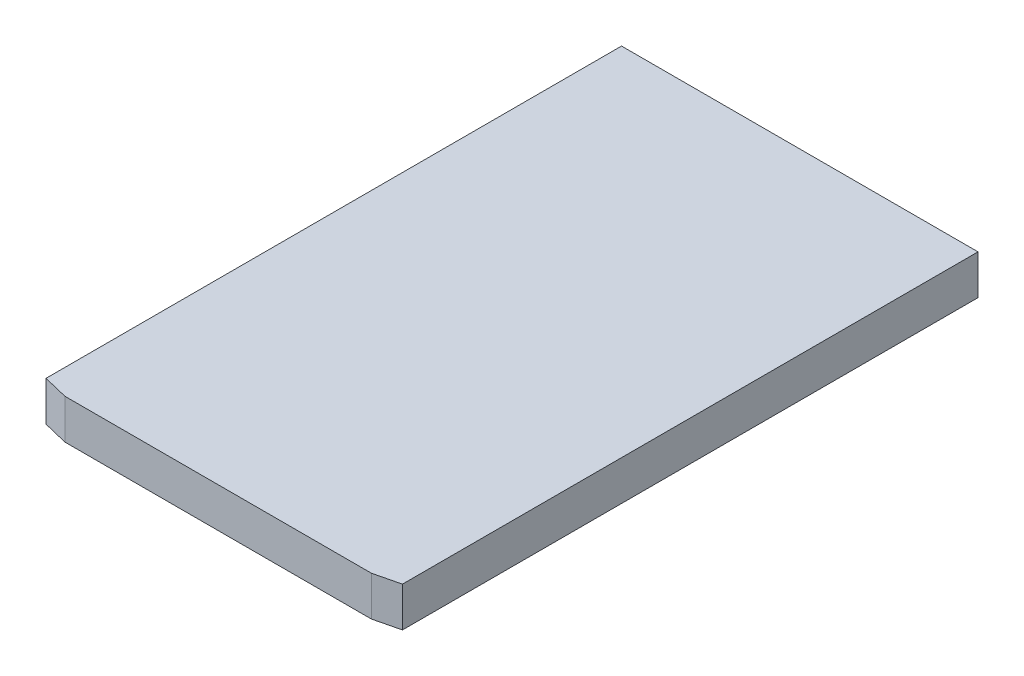
ISO-10303-21;
HEADER;
FILE_DESCRIPTION(('STEP AP214'),'2;1');
FILE_NAME('part.step','',(''),(''),'','','');
FILE_SCHEMA(('AUTOMOTIVE_DESIGN { 1 0 10303 214 1 1 1 1 }'));
ENDSEC;
DATA;
#1=APPLICATION_CONTEXT('core data for automotive mechanical design processes');
#2=APPLICATION_PROTOCOL_DEFINITION('international standard','automotive_design',2000,#1);
#3=PRODUCT_CONTEXT('',#1,'mechanical');
#4=PRODUCT('Part','Part','',(#3));
#5=PRODUCT_RELATED_PRODUCT_CATEGORY('part','',(#4));
#6=PRODUCT_DEFINITION_FORMATION('','',#4);
#7=PRODUCT_DEFINITION_CONTEXT('part definition',#1,'design');
#8=PRODUCT_DEFINITION('design','',#6,#7);
#9=PRODUCT_DEFINITION_SHAPE('','',#8);
#10=(LENGTH_UNIT() NAMED_UNIT(*) SI_UNIT(.MILLI.,.METRE.));
#11=(NAMED_UNIT(*) PLANE_ANGLE_UNIT() SI_UNIT($,.RADIAN.));
#12=(NAMED_UNIT(*) SI_UNIT($,.STERADIAN.) SOLID_ANGLE_UNIT());
#13=UNCERTAINTY_MEASURE_WITH_UNIT(LENGTH_MEASURE(1.E-05),#10,'distance_accuracy_value','');
#14=(GEOMETRIC_REPRESENTATION_CONTEXT(3) GLOBAL_UNCERTAINTY_ASSIGNED_CONTEXT((#13)) GLOBAL_UNIT_ASSIGNED_CONTEXT((#10,
#11,#12)) REPRESENTATION_CONTEXT('',''));
#15=CARTESIAN_POINT('',(0.,0.,0.));
#16=DIRECTION('',(0.,0.,1.));
#17=DIRECTION('',(1.,0.,0.));
#18=AXIS2_PLACEMENT_3D('',#15,#16,#17);
#19=CARTESIAN_POINT('',(0.,-66.,0.100005032445752));
#20=DIRECTION('',(0.,-1.,0.));
#21=DIRECTION('',(0.,0.,-1.));
#22=AXIS2_PLACEMENT_3D('',#19,#20,#21);
#23=PLANE('',#22);
#24=DIRECTION('',(1.,0.,0.));
#25=VECTOR('',#24,1.);
#26=CARTESIAN_POINT('',(12.25,-66.,35.2499999999999));
#27=LINE('',#26,#25);
#28=CARTESIAN_POINT('',(-12.2500000000025,-66.0000000000021,35.2499999999999));
#29=VERTEX_POINT('',#28);
#30=CARTESIAN_POINT('',(12.25,-66.,35.25));
#31=VERTEX_POINT('',#30);
#32=EDGE_CURVE('E66',#29,#31,#27,.T.);
#33=ORIENTED_EDGE('',*,*,#32,.F.);
#34=DIRECTION('',(0.971714790279196,0.,0.236157503274105));
#35=VECTOR('',#34,1.);
#36=CARTESIAN_POINT('',(-74.9989954719028,-66.0000000000083,20.0000045776342));
#37=LINE('',#36,#35);
#38=CARTESIAN_POINT('',(-14.2500000000032,-66.0000000000021,34.7639365879101));
#39=VERTEX_POINT('',#38);
#40=EDGE_CURVE('E93',#39,#29,#37,.T.);
#41=ORIENTED_EDGE('',*,*,#40,.F.);
#42=DIRECTION('',(0.,0.,1.));
#43=VECTOR('',#42,1.);
#44=CARTESIAN_POINT('',(-14.25,-66.,33.25));
#45=LINE('',#44,#43);
#46=CARTESIAN_POINT('',(-14.2500000000007,-66.,-11.2500000000043));
#47=VERTEX_POINT('',#46);
#48=EDGE_CURVE('E97',#47,#39,#45,.T.);
#49=ORIENTED_EDGE('',*,*,#48,.F.);
#50=DIRECTION('',(-1.,0.,0.));
#51=VECTOR('',#50,1.);
#52=CARTESIAN_POINT('',(-12.2499999999998,-66.,-11.2500000000003));
#53=LINE('',#52,#51);
#54=CARTESIAN_POINT('',(14.25,-66.0000000000364,-11.2500000000002));
#55=VERTEX_POINT('',#54);
#56=EDGE_CURVE('E82',#55,#47,#53,.T.);
#57=ORIENTED_EDGE('',*,*,#56,.F.);
#58=DIRECTION('',(0.,0.,1.));
#59=VECTOR('',#58,1.);
#60=CARTESIAN_POINT('',(14.25,-66.0000000000728,23.4717912863478));
#61=LINE('',#60,#59);
#62=CARTESIAN_POINT('',(14.25,-66.0000000000182,34.763936587932));
#63=VERTEX_POINT('',#62);
#64=EDGE_CURVE('E20',#63,#55,#61,.F.);
#65=ORIENTED_EDGE('',*,*,#64,.F.);
#66=DIRECTION('',(0.971714790279195,0.,-0.236157503274106));
#67=VECTOR('',#66,1.);
#68=CARTESIAN_POINT('',(12.25,-66.,35.25));
#69=LINE('',#68,#67);
#70=EDGE_CURVE('E71',#31,#63,#69,.T.);
#71=ORIENTED_EDGE('',*,*,#70,.F.);
#72=EDGE_LOOP('',(#33,#41,#49,#57,#65,#71));
#73=FACE_BOUND('',#72,.T.);
#74=ADVANCED_FACE('F17',(#73),#23,.T.);
#75=CARTESIAN_POINT('',(14.25,-23.,23.4717912863478));
#76=DIRECTION('',(1.,0.,0.));
#77=DIRECTION('',(0.,1.,0.));
#78=AXIS2_PLACEMENT_3D('',#75,#76,#77);
#79=PLANE('',#78);
#80=ORIENTED_EDGE('',*,*,#64,.T.);
#81=DIRECTION('',(0.,1.,0.));
#82=VECTOR('',#81,1.);
#83=CARTESIAN_POINT('',(14.25,-23.,-11.2500000000001));
#84=LINE('',#83,#82);
#85=CARTESIAN_POINT('',(14.25,-62.825,-11.250000000004));
#86=VERTEX_POINT('',#85);
#87=EDGE_CURVE('E101',#86,#55,#84,.F.);
#88=ORIENTED_EDGE('',*,*,#87,.F.);
#89=DIRECTION('',(0.,0.,-1.));
#90=VECTOR('',#89,1.);
#91=CARTESIAN_POINT('',(14.25,-62.825,0.100005032445854));
#92=LINE('',#91,#90);
#93=CARTESIAN_POINT('',(14.25,-62.825,34.7639365879014));
#94=VERTEX_POINT('',#93);
#95=EDGE_CURVE('E88',#86,#94,#92,.F.);
#96=ORIENTED_EDGE('',*,*,#95,.T.);
#97=DIRECTION('',(0.,1.,0.));
#98=VECTOR('',#97,1.);
#99=CARTESIAN_POINT('',(14.2499999999999,-66.,34.763936587903));
#100=LINE('',#99,#98);
#101=EDGE_CURVE('E76',#63,#94,#100,.T.);
#102=ORIENTED_EDGE('',*,*,#101,.F.);
#103=EDGE_LOOP('',(#80,#88,#96,#102));
#104=FACE_BOUND('',#103,.T.);
#105=ADVANCED_FACE('F87',(#104),#79,.T.);
#106=CARTESIAN_POINT('',(12.25,-66.,35.25));
#107=DIRECTION('',(0.236157503274106,0.,0.971714790279195));
#108=DIRECTION('',(0.971714790279195,0.,-0.236157503274106));
#109=AXIS2_PLACEMENT_3D('',#106,#107,#108);
#110=PLANE('',#109);
#111=ORIENTED_EDGE('',*,*,#70,.T.);
#112=ORIENTED_EDGE('',*,*,#101,.T.);
#113=DIRECTION('',(-0.971714790279194,0.,0.236157503274111));
#114=VECTOR('',#113,1.);
#115=CARTESIAN_POINT('',(14.2500000000136,-62.8250000000001,34.7639365878997));
#116=LINE('',#115,#114);
#117=CARTESIAN_POINT('',(12.25,-62.825,35.25));
#118=VERTEX_POINT('',#117);
#119=EDGE_CURVE('E106',#94,#118,#116,.T.);
#120=ORIENTED_EDGE('',*,*,#119,.T.);
#121=DIRECTION('',(0.,-1.,0.));
#122=VECTOR('',#121,1.);
#123=CARTESIAN_POINT('',(12.25,-23.,35.25));
#124=LINE('',#123,#122);
#125=EDGE_CURVE('E78',#31,#118,#124,.F.);
#126=ORIENTED_EDGE('',*,*,#125,.F.);
#127=EDGE_LOOP('',(#111,#112,#120,#126));
#128=FACE_BOUND('',#127,.T.);
#129=ADVANCED_FACE('F73',(#128),#110,.T.);
#130=CARTESIAN_POINT('',(12.25,-23.,35.25));
#131=DIRECTION('',(0.,0.,1.));
#132=DIRECTION('',(0.,-1.,0.));
#133=AXIS2_PLACEMENT_3D('',#130,#131,#132);
#134=PLANE('',#133);
#135=ORIENTED_EDGE('',*,*,#32,.T.);
#136=ORIENTED_EDGE('',*,*,#125,.T.);
#137=DIRECTION('',(1.,0.,0.));
#138=VECTOR('',#137,1.);
#139=CARTESIAN_POINT('',(0.,-62.8250000000001,35.25));
#140=LINE('',#139,#138);
#141=CARTESIAN_POINT('',(-12.250000000021,-62.825,35.2499999999999));
#142=VERTEX_POINT('',#141);
#143=EDGE_CURVE('E108',#118,#142,#140,.F.);
#144=ORIENTED_EDGE('',*,*,#143,.T.);
#145=DIRECTION('',(0.,1.,0.));
#146=VECTOR('',#145,1.);
#147=CARTESIAN_POINT('',(-12.25,-66.,35.2499999999998));
#148=LINE('',#147,#146);
#149=EDGE_CURVE('E95',#29,#142,#148,.T.);
#150=ORIENTED_EDGE('',*,*,#149,.F.);
#151=EDGE_LOOP('',(#135,#136,#144,#150));
#152=FACE_BOUND('',#151,.T.);
#153=ADVANCED_FACE('F126',(#152),#134,.T.);
#154=CARTESIAN_POINT('',(-74.9989954719028,-66.,20.0000045776342));
#155=DIRECTION('',(-0.236157503274105,0.,0.971714790279196));
#156=DIRECTION('',(0.971714790279196,0.,0.236157503274105));
#157=AXIS2_PLACEMENT_3D('',#154,#155,#156);
#158=PLANE('',#157);
#159=ORIENTED_EDGE('',*,*,#40,.T.);
#160=ORIENTED_EDGE('',*,*,#149,.T.);
#161=DIRECTION('',(-0.971714790277447,0.,-0.236157503281298));
#162=VECTOR('',#161,1.);
#163=CARTESIAN_POINT('',(-12.2500000000101,-62.8250000000001,35.250000000013));
#164=LINE('',#163,#162);
#165=CARTESIAN_POINT('',(-14.2500000000059,-62.825,34.763936587904));
#166=VERTEX_POINT('',#165);
#167=EDGE_CURVE('E111',#142,#166,#164,.T.);
#168=ORIENTED_EDGE('',*,*,#167,.T.);
#169=DIRECTION('',(0.,1.,0.));
#170=VECTOR('',#169,1.);
#171=CARTESIAN_POINT('',(-14.25,-23.,34.7639365879131));
#172=LINE('',#171,#170);
#173=EDGE_CURVE('E99',#39,#166,#172,.T.);
#174=ORIENTED_EDGE('',*,*,#173,.F.);
#175=EDGE_LOOP('',(#159,#160,#168,#174));
#176=FACE_BOUND('',#175,.T.);
#177=ADVANCED_FACE('F124',(#176),#158,.T.);
#178=CARTESIAN_POINT('',(-14.25,-23.,33.25));
#179=DIRECTION('',(-1.,0.,0.));
#180=DIRECTION('',(0.,0.,1.));
#181=AXIS2_PLACEMENT_3D('',#178,#179,#180);
#182=PLANE('',#181);
#183=ORIENTED_EDGE('',*,*,#48,.T.);
#184=ORIENTED_EDGE('',*,*,#173,.T.);
#185=DIRECTION('',(0.,0.,-1.));
#186=VECTOR('',#185,1.);
#187=CARTESIAN_POINT('',(-14.2500000000078,-62.825,0.100005032445854));
#188=LINE('',#187,#186);
#189=CARTESIAN_POINT('',(-14.2500000000011,-62.825,-11.2500000000119));
#190=VERTEX_POINT('',#189);
#191=EDGE_CURVE('E26',#166,#190,#188,.T.);
#192=ORIENTED_EDGE('',*,*,#191,.T.);
#193=DIRECTION('',(0.,1.,0.));
#194=VECTOR('',#193,1.);
#195=CARTESIAN_POINT('',(-14.2499999999989,-23.,-11.2500000000002));
#196=LINE('',#195,#194);
#197=EDGE_CURVE('E34',#47,#190,#196,.T.);
#198=ORIENTED_EDGE('',*,*,#197,.F.);
#199=EDGE_LOOP('',(#183,#184,#192,#198));
#200=FACE_BOUND('',#199,.T.);
#201=ADVANCED_FACE('F117',(#200),#182,.T.);
#202=CARTESIAN_POINT('',(-12.2499999999998,-23.,-11.2500000000002));
#203=DIRECTION('',(0.,0.,-1.));
#204=DIRECTION('',(-1.,0.,0.));
#205=AXIS2_PLACEMENT_3D('',#202,#203,#204);
#206=PLANE('',#205);
#207=ORIENTED_EDGE('',*,*,#56,.T.);
#208=ORIENTED_EDGE('',*,*,#197,.T.);
#209=DIRECTION('',(1.,0.,0.));
#210=VECTOR('',#209,1.);
#211=CARTESIAN_POINT('',(0.,-62.825,-11.2500000000158));
#212=LINE('',#211,#210);
#213=EDGE_CURVE('E11',#190,#86,#212,.T.);
#214=ORIENTED_EDGE('',*,*,#213,.T.);
#215=ORIENTED_EDGE('',*,*,#87,.T.);
#216=EDGE_LOOP('',(#207,#208,#214,#215));
#217=FACE_BOUND('',#216,.T.);
#218=ADVANCED_FACE('F127',(#217),#206,.T.);
#219=CARTESIAN_POINT('',(0.,-62.825,0.100005032445854));
#220=DIRECTION('',(0.,-1.,0.));
#221=DIRECTION('',(0.,0.,-1.));
#222=AXIS2_PLACEMENT_3D('',#219,#220,#221);
#223=PLANE('',#222);
#224=ORIENTED_EDGE('',*,*,#191,.F.);
#225=ORIENTED_EDGE('',*,*,#167,.F.);
#226=ORIENTED_EDGE('',*,*,#143,.F.);
#227=ORIENTED_EDGE('',*,*,#119,.F.);
#228=ORIENTED_EDGE('',*,*,#95,.F.);
#229=ORIENTED_EDGE('',*,*,#213,.F.);
#230=EDGE_LOOP('',(#224,#225,#226,#227,#228,#229));
#231=FACE_BOUND('',#230,.T.);
#232=ADVANCED_FACE('F121',(#231),#223,.F.);
#233=CLOSED_SHELL('',(#74,#105,#129,#153,#177,#201,#218,#232));
#234=MANIFOLD_SOLID_BREP('B1',#233);
#235=ADVANCED_BREP_SHAPE_REPRESENTATION('',(#18,#234),#14);
#236=SHAPE_DEFINITION_REPRESENTATION(#9,#235);
ENDSEC;
END-ISO-10303-21;
